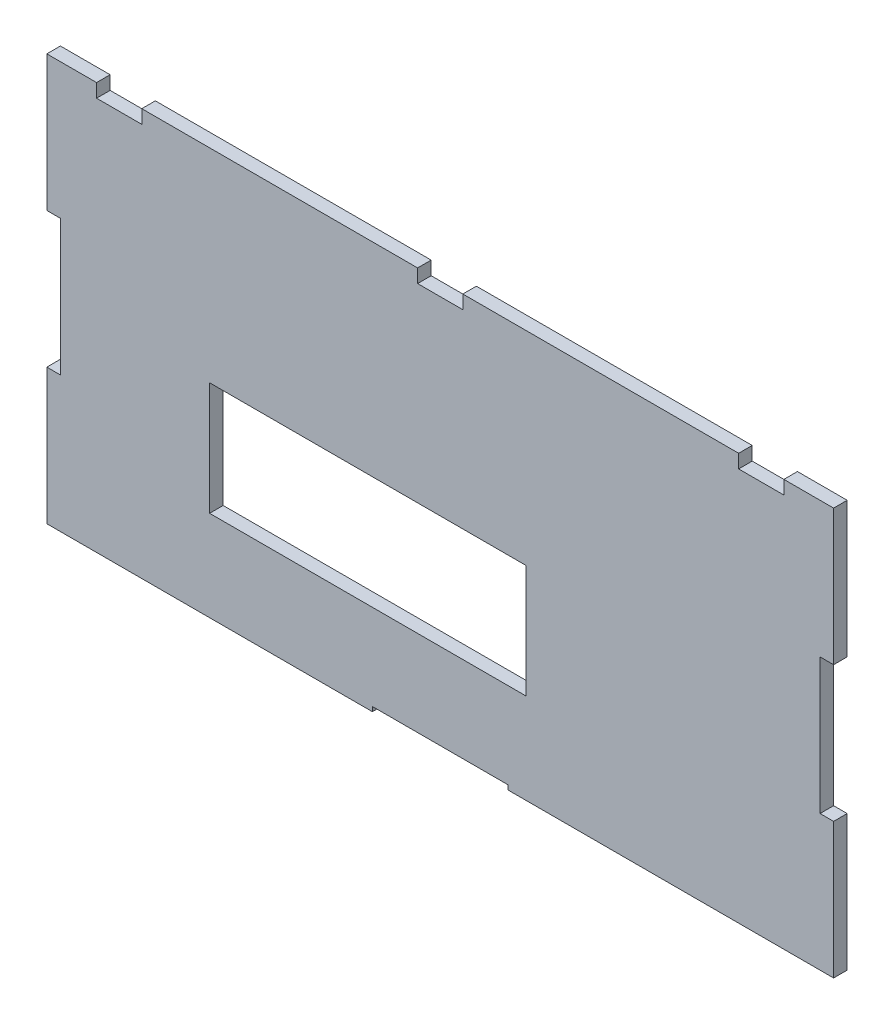
ISO-10303-21;
HEADER;
FILE_DESCRIPTION(('STEP AP214'),'2;1');
FILE_NAME('part.step','',(''),(''),'','','');
FILE_SCHEMA(('AUTOMOTIVE_DESIGN { 1 0 10303 214 1 1 1 1 }'));
ENDSEC;
DATA;
#1=APPLICATION_CONTEXT('core data for automotive mechanical design processes');
#2=APPLICATION_PROTOCOL_DEFINITION('international standard','automotive_design',2000,#1);
#3=PRODUCT_CONTEXT('',#1,'mechanical');
#4=PRODUCT('Part','Part','',(#3));
#5=PRODUCT_RELATED_PRODUCT_CATEGORY('part','',(#4));
#6=PRODUCT_DEFINITION_FORMATION('','',#4);
#7=PRODUCT_DEFINITION_CONTEXT('part definition',#1,'design');
#8=PRODUCT_DEFINITION('design','',#6,#7);
#9=PRODUCT_DEFINITION_SHAPE('','',#8);
#10=(LENGTH_UNIT() NAMED_UNIT(*) SI_UNIT(.MILLI.,.METRE.));
#11=(NAMED_UNIT(*) PLANE_ANGLE_UNIT() SI_UNIT($,.RADIAN.));
#12=(NAMED_UNIT(*) SI_UNIT($,.STERADIAN.) SOLID_ANGLE_UNIT());
#13=UNCERTAINTY_MEASURE_WITH_UNIT(LENGTH_MEASURE(1.E-05),#10,'distance_accuracy_value','');
#14=(GEOMETRIC_REPRESENTATION_CONTEXT(3) GLOBAL_UNCERTAINTY_ASSIGNED_CONTEXT((#13)) GLOBAL_UNIT_ASSIGNED_CONTEXT((#10,
#11,#12)) REPRESENTATION_CONTEXT('',''));
#15=CARTESIAN_POINT('',(0.,0.,0.));
#16=DIRECTION('',(0.,0.,1.));
#17=DIRECTION('',(1.,0.,0.));
#18=AXIS2_PLACEMENT_3D('',#15,#16,#17);
#19=CARTESIAN_POINT('',(0.,0.,3.));
#20=DIRECTION('',(0.,0.,1.));
#21=DIRECTION('',(1.,0.,0.));
#22=AXIS2_PLACEMENT_3D('',#19,#20,#21);
#23=PLANE('',#22);
#24=DIRECTION('',(1.,0.,0.));
#25=VECTOR('',#24,1.);
#26=CARTESIAN_POINT('',(180.402887007917,-58.0847241042454,3.));
#27=LINE('',#26,#25);
#28=CARTESIAN_POINT('',(180.402887007917,-58.0847241042454,3.));
#29=VERTEX_POINT('',#28);
#30=CARTESIAN_POINT('',(252.402887007917,-58.0847241042454,3.));
#31=VERTEX_POINT('',#30);
#32=EDGE_CURVE('E277',#29,#31,#27,.T.);
#33=ORIENTED_EDGE('',*,*,#32,.T.);
#34=DIRECTION('',(0.,1.,0.));
#35=VECTOR('',#34,1.);
#36=CARTESIAN_POINT('',(252.402887007917,-58.0847241042454,3.));
#37=LINE('',#36,#35);
#38=CARTESIAN_POINT('',(252.402887007917,-28.0847241042453,3.));
#39=VERTEX_POINT('',#38);
#40=EDGE_CURVE('E280',#31,#39,#37,.T.);
#41=ORIENTED_EDGE('',*,*,#40,.T.);
#42=DIRECTION('',(-1.,0.,0.));
#43=VECTOR('',#42,1.);
#44=CARTESIAN_POINT('',(252.402887007917,-28.0847241042453,3.));
#45=LINE('',#44,#43);
#46=CARTESIAN_POINT('',(249.402887007917,-28.0847241042452,3.));
#47=VERTEX_POINT('',#46);
#48=EDGE_CURVE('E283',#39,#47,#45,.T.);
#49=ORIENTED_EDGE('',*,*,#48,.T.);
#50=DIRECTION('',(0.,1.,0.));
#51=VECTOR('',#50,1.);
#52=CARTESIAN_POINT('',(249.402887007917,1.91527589575478,3.));
#53=LINE('',#52,#51);
#54=CARTESIAN_POINT('',(249.402887007917,1.91527589575478,3.));
#55=VERTEX_POINT('',#54);
#56=EDGE_CURVE('E285',#47,#55,#53,.T.);
#57=ORIENTED_EDGE('',*,*,#56,.T.);
#58=DIRECTION('',(1.,0.,0.));
#59=VECTOR('',#58,1.);
#60=CARTESIAN_POINT('',(249.402887007917,1.91527589575478,3.));
#61=LINE('',#60,#59);
#62=CARTESIAN_POINT('',(252.402887007917,1.91527589575481,3.));
#63=VERTEX_POINT('',#62);
#64=EDGE_CURVE('E287',#55,#63,#61,.T.);
#65=ORIENTED_EDGE('',*,*,#64,.T.);
#66=DIRECTION('',(0.,1.,0.));
#67=VECTOR('',#66,1.);
#68=CARTESIAN_POINT('',(252.402887007917,1.91527589575481,3.));
#69=LINE('',#68,#67);
#70=CARTESIAN_POINT('',(252.402887007917,31.9152758957548,3.));
#71=VERTEX_POINT('',#70);
#72=EDGE_CURVE('E289',#63,#71,#69,.T.);
#73=ORIENTED_EDGE('',*,*,#72,.T.);
#74=DIRECTION('',(-1.,0.,0.));
#75=VECTOR('',#74,1.);
#76=CARTESIAN_POINT('',(241.402887007917,31.9152758957548,3.));
#77=LINE('',#76,#75);
#78=CARTESIAN_POINT('',(241.402887007917,31.9152758957548,3.));
#79=VERTEX_POINT('',#78);
#80=EDGE_CURVE('E291',#71,#79,#77,.T.);
#81=ORIENTED_EDGE('',*,*,#80,.T.);
#82=DIRECTION('',(0.,-1.,0.));
#83=VECTOR('',#82,1.);
#84=CARTESIAN_POINT('',(241.402887007917,28.9152758957548,3.));
#85=LINE('',#84,#83);
#86=CARTESIAN_POINT('',(241.402887007917,28.9152758957548,3.));
#87=VERTEX_POINT('',#86);
#88=EDGE_CURVE('E293',#79,#87,#85,.T.);
#89=ORIENTED_EDGE('',*,*,#88,.T.);
#90=DIRECTION('',(-1.,0.,0.));
#91=VECTOR('',#90,1.);
#92=CARTESIAN_POINT('',(231.402887007916,28.9152758957548,3.));
#93=LINE('',#92,#91);
#94=CARTESIAN_POINT('',(231.402887007916,28.9152758957548,3.));
#95=VERTEX_POINT('',#94);
#96=EDGE_CURVE('E295',#87,#95,#93,.T.);
#97=ORIENTED_EDGE('',*,*,#96,.T.);
#98=DIRECTION('',(0.,1.,0.));
#99=VECTOR('',#98,1.);
#100=CARTESIAN_POINT('',(231.402887007916,31.9152758957548,3.));
#101=LINE('',#100,#99);
#102=CARTESIAN_POINT('',(231.402887007916,31.9152758957548,3.));
#103=VERTEX_POINT('',#102);
#104=EDGE_CURVE('E297',#95,#103,#101,.T.);
#105=ORIENTED_EDGE('',*,*,#104,.T.);
#106=DIRECTION('',(-1.,0.,0.));
#107=VECTOR('',#106,1.);
#108=CARTESIAN_POINT('',(170.402887007916,31.9152758957548,3.));
#109=LINE('',#108,#107);
#110=CARTESIAN_POINT('',(170.402887007916,31.9152758957548,3.));
#111=VERTEX_POINT('',#110);
#112=EDGE_CURVE('E299',#103,#111,#109,.T.);
#113=ORIENTED_EDGE('',*,*,#112,.T.);
#114=DIRECTION('',(0.,-1.,0.));
#115=VECTOR('',#114,1.);
#116=CARTESIAN_POINT('',(170.402887007916,28.9152758957548,3.));
#117=LINE('',#116,#115);
#118=CARTESIAN_POINT('',(170.402887007916,28.9152758957548,3.));
#119=VERTEX_POINT('',#118);
#120=EDGE_CURVE('E301',#111,#119,#117,.T.);
#121=ORIENTED_EDGE('',*,*,#120,.T.);
#122=DIRECTION('',(-1.,0.,0.));
#123=VECTOR('',#122,1.);
#124=CARTESIAN_POINT('',(160.402887007916,28.9152758957548,3.));
#125=LINE('',#124,#123);
#126=CARTESIAN_POINT('',(160.402887007916,28.9152758957548,3.));
#127=VERTEX_POINT('',#126);
#128=EDGE_CURVE('E303',#119,#127,#125,.T.);
#129=ORIENTED_EDGE('',*,*,#128,.T.);
#130=DIRECTION('',(0.,1.,0.));
#131=VECTOR('',#130,1.);
#132=CARTESIAN_POINT('',(160.402887007916,31.9152758957548,3.));
#133=LINE('',#132,#131);
#134=CARTESIAN_POINT('',(160.402887007916,31.9152758957548,3.));
#135=VERTEX_POINT('',#134);
#136=EDGE_CURVE('E305',#127,#135,#133,.T.);
#137=ORIENTED_EDGE('',*,*,#136,.T.);
#138=DIRECTION('',(-1.,0.,0.));
#139=VECTOR('',#138,1.);
#140=CARTESIAN_POINT('',(99.4028870079165,31.9152758957548,3.));
#141=LINE('',#140,#139);
#142=CARTESIAN_POINT('',(99.4028870079165,31.9152758957548,3.));
#143=VERTEX_POINT('',#142);
#144=EDGE_CURVE('E307',#135,#143,#141,.T.);
#145=ORIENTED_EDGE('',*,*,#144,.T.);
#146=DIRECTION('',(0.,-1.,0.));
#147=VECTOR('',#146,1.);
#148=CARTESIAN_POINT('',(99.4028870079165,28.9152758957548,3.));
#149=LINE('',#148,#147);
#150=CARTESIAN_POINT('',(99.4028870079165,28.9152758957548,3.));
#151=VERTEX_POINT('',#150);
#152=EDGE_CURVE('E309',#143,#151,#149,.T.);
#153=ORIENTED_EDGE('',*,*,#152,.T.);
#154=DIRECTION('',(-1.,0.,0.));
#155=VECTOR('',#154,1.);
#156=CARTESIAN_POINT('',(89.4028870079165,28.9152758957548,3.));
#157=LINE('',#156,#155);
#158=CARTESIAN_POINT('',(89.4028870079165,28.9152758957548,3.));
#159=VERTEX_POINT('',#158);
#160=EDGE_CURVE('E311',#151,#159,#157,.T.);
#161=ORIENTED_EDGE('',*,*,#160,.T.);
#162=DIRECTION('',(0.,1.,0.));
#163=VECTOR('',#162,1.);
#164=CARTESIAN_POINT('',(89.4028870079165,31.9152758957548,3.));
#165=LINE('',#164,#163);
#166=CARTESIAN_POINT('',(89.4028870079165,31.9152758957548,3.));
#167=VERTEX_POINT('',#166);
#168=EDGE_CURVE('E313',#159,#167,#165,.T.);
#169=ORIENTED_EDGE('',*,*,#168,.T.);
#170=DIRECTION('',(-1.,0.,0.));
#171=VECTOR('',#170,1.);
#172=CARTESIAN_POINT('',(78.4028870079165,31.9152758957548,3.));
#173=LINE('',#172,#171);
#174=CARTESIAN_POINT('',(78.4028870079165,31.9152758957548,3.));
#175=VERTEX_POINT('',#174);
#176=EDGE_CURVE('E315',#167,#175,#173,.T.);
#177=ORIENTED_EDGE('',*,*,#176,.T.);
#178=DIRECTION('',(0.,-1.,0.));
#179=VECTOR('',#178,1.);
#180=CARTESIAN_POINT('',(78.4028870079165,31.9152758957548,3.));
#181=LINE('',#180,#179);
#182=CARTESIAN_POINT('',(78.4028870079165,1.91527589575479,3.));
#183=VERTEX_POINT('',#182);
#184=EDGE_CURVE('E317',#175,#183,#181,.T.);
#185=ORIENTED_EDGE('',*,*,#184,.T.);
#186=DIRECTION('',(1.,0.,0.));
#187=VECTOR('',#186,1.);
#188=CARTESIAN_POINT('',(78.4028870079165,1.91527589575479,3.));
#189=LINE('',#188,#187);
#190=CARTESIAN_POINT('',(81.4028870079165,1.91527589575478,3.));
#191=VERTEX_POINT('',#190);
#192=EDGE_CURVE('E319',#183,#191,#189,.T.);
#193=ORIENTED_EDGE('',*,*,#192,.T.);
#194=DIRECTION('',(0.,-1.,0.));
#195=VECTOR('',#194,1.);
#196=CARTESIAN_POINT('',(81.4028870079165,1.91527589575478,3.));
#197=LINE('',#196,#195);
#198=CARTESIAN_POINT('',(81.4028870079165,-28.0847241042452,3.));
#199=VERTEX_POINT('',#198);
#200=EDGE_CURVE('E321',#191,#199,#197,.T.);
#201=ORIENTED_EDGE('',*,*,#200,.T.);
#202=DIRECTION('',(-1.,0.,0.));
#203=VECTOR('',#202,1.);
#204=CARTESIAN_POINT('',(81.4028870079165,-28.0847241042452,3.));
#205=LINE('',#204,#203);
#206=CARTESIAN_POINT('',(78.4028870079166,-28.0847241042453,3.));
#207=VERTEX_POINT('',#206);
#208=EDGE_CURVE('E323',#199,#207,#205,.T.);
#209=ORIENTED_EDGE('',*,*,#208,.T.);
#210=DIRECTION('',(0.,-1.,0.));
#211=VECTOR('',#210,1.);
#212=CARTESIAN_POINT('',(78.4028870079166,-28.0847241042453,3.));
#213=LINE('',#212,#211);
#214=CARTESIAN_POINT('',(78.4028870079165,-58.0847241042454,3.));
#215=VERTEX_POINT('',#214);
#216=EDGE_CURVE('E325',#207,#215,#213,.T.);
#217=ORIENTED_EDGE('',*,*,#216,.T.);
#218=DIRECTION('',(1.,0.,0.));
#219=VECTOR('',#218,1.);
#220=CARTESIAN_POINT('',(78.4028870079165,-58.0847241042454,3.));
#221=LINE('',#220,#219);
#222=CARTESIAN_POINT('',(150.402887007917,-58.0847241042454,3.));
#223=VERTEX_POINT('',#222);
#224=EDGE_CURVE('E327',#215,#223,#221,.T.);
#225=ORIENTED_EDGE('',*,*,#224,.T.);
#226=DIRECTION('',(0.,1.,0.));
#227=VECTOR('',#226,1.);
#228=CARTESIAN_POINT('',(150.402887007917,-57.0847241042454,3.));
#229=LINE('',#228,#227);
#230=CARTESIAN_POINT('',(150.402887007917,-57.0847241042454,3.));
#231=VERTEX_POINT('',#230);
#232=EDGE_CURVE('E329',#223,#231,#229,.T.);
#233=ORIENTED_EDGE('',*,*,#232,.T.);
#234=DIRECTION('',(1.,0.,0.));
#235=VECTOR('',#234,1.);
#236=CARTESIAN_POINT('',(180.402887007917,-57.0847241042454,3.));
#237=LINE('',#236,#235);
#238=CARTESIAN_POINT('',(180.402887007917,-57.0847241042454,3.));
#239=VERTEX_POINT('',#238);
#240=EDGE_CURVE('E331',#231,#239,#237,.T.);
#241=ORIENTED_EDGE('',*,*,#240,.T.);
#242=DIRECTION('',(0.,-1.,0.));
#243=VECTOR('',#242,1.);
#244=CARTESIAN_POINT('',(180.402887007917,-58.0847241042454,3.));
#245=LINE('',#244,#243);
#246=EDGE_CURVE('E333',#239,#29,#245,.T.);
#247=ORIENTED_EDGE('',*,*,#246,.T.);
#248=EDGE_LOOP('',(#33,#41,#49,#57,#65,#73,#81,#89,#97,#105,#113,#121,#129,#137,#145,#153,#161,
#169,#177,#185,#193,#201,#209,#217,#225,#233,#241,#247));
#249=FACE_BOUND('',#248,.T.);
#250=DIRECTION('',(-1.,0.,0.));
#251=VECTOR('',#250,1.);
#252=CARTESIAN_POINT('',(114.402887007917,-13.0847241042452,3.));
#253=LINE('',#252,#251);
#254=CARTESIAN_POINT('',(184.402887007917,-13.0847241042452,3.));
#255=VERTEX_POINT('',#254);
#256=CARTESIAN_POINT('',(114.402887007917,-13.0847241042452,3.));
#257=VERTEX_POINT('',#256);
#258=EDGE_CURVE('E249',#255,#257,#253,.T.);
#259=ORIENTED_EDGE('',*,*,#258,.F.);
#260=DIRECTION('',(0.,1.,0.));
#261=VECTOR('',#260,1.);
#262=CARTESIAN_POINT('',(184.402887007917,-13.0847241042452,3.));
#263=LINE('',#262,#261);
#264=CARTESIAN_POINT('',(184.402887007917,-38.0847241042452,3.));
#265=VERTEX_POINT('',#264);
#266=EDGE_CURVE('E241',#265,#255,#263,.T.);
#267=ORIENTED_EDGE('',*,*,#266,.F.);
#268=DIRECTION('',(1.,0.,0.));
#269=VECTOR('',#268,1.);
#270=CARTESIAN_POINT('',(184.402887007917,-38.0847241042452,3.));
#271=LINE('',#270,#269);
#272=CARTESIAN_POINT('',(114.402887007917,-38.0847241042452,3.));
#273=VERTEX_POINT('',#272);
#274=EDGE_CURVE('E263',#273,#265,#271,.T.);
#275=ORIENTED_EDGE('',*,*,#274,.F.);
#276=DIRECTION('',(0.,-1.,0.));
#277=VECTOR('',#276,1.);
#278=CARTESIAN_POINT('',(114.402887007917,-38.0847241042452,3.));
#279=LINE('',#278,#277);
#280=EDGE_CURVE('E261',#257,#273,#279,.T.);
#281=ORIENTED_EDGE('',*,*,#280,.F.);
#282=EDGE_LOOP('',(#259,#267,#275,#281));
#283=FACE_BOUND('',#282,.T.);
#284=ADVANCED_FACE('F32',(#249,#283),#23,.T.);
#285=CARTESIAN_POINT('',(0.,0.,0.));
#286=DIRECTION('',(0.,0.,1.));
#287=DIRECTION('',(1.,0.,0.));
#288=AXIS2_PLACEMENT_3D('',#285,#286,#287);
#289=PLANE('',#288);
#290=DIRECTION('',(1.,0.,0.));
#291=VECTOR('',#290,1.);
#292=CARTESIAN_POINT('',(180.402887007917,-58.0847241042454,0.));
#293=LINE('',#292,#291);
#294=CARTESIAN_POINT('',(180.402887007917,-58.0847241042454,0.));
#295=VERTEX_POINT('',#294);
#296=CARTESIAN_POINT('',(252.402887007917,-58.0847241042454,0.));
#297=VERTEX_POINT('',#296);
#298=EDGE_CURVE('E257',#295,#297,#293,.T.);
#299=ORIENTED_EDGE('',*,*,#298,.F.);
#300=DIRECTION('',(0.,-1.,0.));
#301=VECTOR('',#300,1.);
#302=CARTESIAN_POINT('',(180.402887007917,-58.0847241042454,0.));
#303=LINE('',#302,#301);
#304=CARTESIAN_POINT('',(180.402887007917,-57.0847241042454,0.));
#305=VERTEX_POINT('',#304);
#306=EDGE_CURVE('E281',#305,#295,#303,.T.);
#307=ORIENTED_EDGE('',*,*,#306,.F.);
#308=DIRECTION('',(1.,0.,0.));
#309=VECTOR('',#308,1.);
#310=CARTESIAN_POINT('',(180.402887007917,-57.0847241042454,0.));
#311=LINE('',#310,#309);
#312=CARTESIAN_POINT('',(150.402887007917,-57.0847241042454,0.));
#313=VERTEX_POINT('',#312);
#314=EDGE_CURVE('E388',#313,#305,#311,.T.);
#315=ORIENTED_EDGE('',*,*,#314,.F.);
#316=DIRECTION('',(0.,1.,0.));
#317=VECTOR('',#316,1.);
#318=CARTESIAN_POINT('',(150.402887007917,-57.0847241042454,0.));
#319=LINE('',#318,#317);
#320=CARTESIAN_POINT('',(150.402887007917,-58.0847241042454,0.));
#321=VERTEX_POINT('',#320);
#322=EDGE_CURVE('E386',#321,#313,#319,.T.);
#323=ORIENTED_EDGE('',*,*,#322,.F.);
#324=DIRECTION('',(1.,0.,0.));
#325=VECTOR('',#324,1.);
#326=CARTESIAN_POINT('',(78.4028870079165,-58.0847241042454,0.));
#327=LINE('',#326,#325);
#328=CARTESIAN_POINT('',(78.4028870079165,-58.0847241042454,0.));
#329=VERTEX_POINT('',#328);
#330=EDGE_CURVE('E384',#329,#321,#327,.T.);
#331=ORIENTED_EDGE('',*,*,#330,.F.);
#332=DIRECTION('',(0.,-1.,0.));
#333=VECTOR('',#332,1.);
#334=CARTESIAN_POINT('',(78.4028870079166,-28.0847241042453,0.));
#335=LINE('',#334,#333);
#336=CARTESIAN_POINT('',(78.4028870079166,-28.0847241042453,0.));
#337=VERTEX_POINT('',#336);
#338=EDGE_CURVE('E382',#337,#329,#335,.T.);
#339=ORIENTED_EDGE('',*,*,#338,.F.);
#340=DIRECTION('',(-1.,0.,0.));
#341=VECTOR('',#340,1.);
#342=CARTESIAN_POINT('',(81.4028870079165,-28.0847241042452,0.));
#343=LINE('',#342,#341);
#344=CARTESIAN_POINT('',(81.4028870079165,-28.0847241042452,0.));
#345=VERTEX_POINT('',#344);
#346=EDGE_CURVE('E380',#345,#337,#343,.T.);
#347=ORIENTED_EDGE('',*,*,#346,.F.);
#348=DIRECTION('',(0.,-1.,0.));
#349=VECTOR('',#348,1.);
#350=CARTESIAN_POINT('',(81.4028870079165,1.91527589575478,0.));
#351=LINE('',#350,#349);
#352=CARTESIAN_POINT('',(81.4028870079165,1.91527589575478,0.));
#353=VERTEX_POINT('',#352);
#354=EDGE_CURVE('E378',#353,#345,#351,.T.);
#355=ORIENTED_EDGE('',*,*,#354,.F.);
#356=DIRECTION('',(1.,0.,0.));
#357=VECTOR('',#356,1.);
#358=CARTESIAN_POINT('',(78.4028870079165,1.91527589575479,0.));
#359=LINE('',#358,#357);
#360=CARTESIAN_POINT('',(78.4028870079165,1.91527589575479,0.));
#361=VERTEX_POINT('',#360);
#362=EDGE_CURVE('E376',#361,#353,#359,.T.);
#363=ORIENTED_EDGE('',*,*,#362,.F.);
#364=DIRECTION('',(0.,-1.,0.));
#365=VECTOR('',#364,1.);
#366=CARTESIAN_POINT('',(78.4028870079165,31.9152758957548,0.));
#367=LINE('',#366,#365);
#368=CARTESIAN_POINT('',(78.4028870079165,31.9152758957548,0.));
#369=VERTEX_POINT('',#368);
#370=EDGE_CURVE('E374',#369,#361,#367,.T.);
#371=ORIENTED_EDGE('',*,*,#370,.F.);
#372=DIRECTION('',(-1.,0.,0.));
#373=VECTOR('',#372,1.);
#374=CARTESIAN_POINT('',(78.4028870079165,31.9152758957548,0.));
#375=LINE('',#374,#373);
#376=CARTESIAN_POINT('',(89.4028870079165,31.9152758957548,0.));
#377=VERTEX_POINT('',#376);
#378=EDGE_CURVE('E372',#377,#369,#375,.T.);
#379=ORIENTED_EDGE('',*,*,#378,.F.);
#380=DIRECTION('',(0.,1.,0.));
#381=VECTOR('',#380,1.);
#382=CARTESIAN_POINT('',(89.4028870079165,31.9152758957548,0.));
#383=LINE('',#382,#381);
#384=CARTESIAN_POINT('',(89.4028870079165,28.9152758957548,0.));
#385=VERTEX_POINT('',#384);
#386=EDGE_CURVE('E370',#385,#377,#383,.T.);
#387=ORIENTED_EDGE('',*,*,#386,.F.);
#388=DIRECTION('',(-1.,0.,0.));
#389=VECTOR('',#388,1.);
#390=CARTESIAN_POINT('',(89.4028870079165,28.9152758957548,0.));
#391=LINE('',#390,#389);
#392=CARTESIAN_POINT('',(99.4028870079165,28.9152758957548,0.));
#393=VERTEX_POINT('',#392);
#394=EDGE_CURVE('E368',#393,#385,#391,.T.);
#395=ORIENTED_EDGE('',*,*,#394,.F.);
#396=DIRECTION('',(0.,-1.,0.));
#397=VECTOR('',#396,1.);
#398=CARTESIAN_POINT('',(99.4028870079165,28.9152758957548,0.));
#399=LINE('',#398,#397);
#400=CARTESIAN_POINT('',(99.4028870079165,31.9152758957548,0.));
#401=VERTEX_POINT('',#400);
#402=EDGE_CURVE('E366',#401,#393,#399,.T.);
#403=ORIENTED_EDGE('',*,*,#402,.F.);
#404=DIRECTION('',(-1.,0.,0.));
#405=VECTOR('',#404,1.);
#406=CARTESIAN_POINT('',(99.4028870079165,31.9152758957548,0.));
#407=LINE('',#406,#405);
#408=CARTESIAN_POINT('',(160.402887007916,31.9152758957548,0.));
#409=VERTEX_POINT('',#408);
#410=EDGE_CURVE('E364',#409,#401,#407,.T.);
#411=ORIENTED_EDGE('',*,*,#410,.F.);
#412=DIRECTION('',(0.,1.,0.));
#413=VECTOR('',#412,1.);
#414=CARTESIAN_POINT('',(160.402887007916,31.9152758957548,0.));
#415=LINE('',#414,#413);
#416=CARTESIAN_POINT('',(160.402887007916,28.9152758957548,0.));
#417=VERTEX_POINT('',#416);
#418=EDGE_CURVE('E362',#417,#409,#415,.T.);
#419=ORIENTED_EDGE('',*,*,#418,.F.);
#420=DIRECTION('',(-1.,0.,0.));
#421=VECTOR('',#420,1.);
#422=CARTESIAN_POINT('',(160.402887007916,28.9152758957548,0.));
#423=LINE('',#422,#421);
#424=CARTESIAN_POINT('',(170.402887007916,28.9152758957548,0.));
#425=VERTEX_POINT('',#424);
#426=EDGE_CURVE('E360',#425,#417,#423,.T.);
#427=ORIENTED_EDGE('',*,*,#426,.F.);
#428=DIRECTION('',(0.,-1.,0.));
#429=VECTOR('',#428,1.);
#430=CARTESIAN_POINT('',(170.402887007916,28.9152758957548,0.));
#431=LINE('',#430,#429);
#432=CARTESIAN_POINT('',(170.402887007916,31.9152758957548,0.));
#433=VERTEX_POINT('',#432);
#434=EDGE_CURVE('E358',#433,#425,#431,.T.);
#435=ORIENTED_EDGE('',*,*,#434,.F.);
#436=DIRECTION('',(-1.,0.,0.));
#437=VECTOR('',#436,1.);
#438=CARTESIAN_POINT('',(170.402887007916,31.9152758957548,0.));
#439=LINE('',#438,#437);
#440=CARTESIAN_POINT('',(231.402887007916,31.9152758957548,0.));
#441=VERTEX_POINT('',#440);
#442=EDGE_CURVE('E356',#441,#433,#439,.T.);
#443=ORIENTED_EDGE('',*,*,#442,.F.);
#444=DIRECTION('',(0.,1.,0.));
#445=VECTOR('',#444,1.);
#446=CARTESIAN_POINT('',(231.402887007916,31.9152758957548,0.));
#447=LINE('',#446,#445);
#448=CARTESIAN_POINT('',(231.402887007916,28.9152758957548,0.));
#449=VERTEX_POINT('',#448);
#450=EDGE_CURVE('E354',#449,#441,#447,.T.);
#451=ORIENTED_EDGE('',*,*,#450,.F.);
#452=DIRECTION('',(-1.,0.,0.));
#453=VECTOR('',#452,1.);
#454=CARTESIAN_POINT('',(231.402887007916,28.9152758957548,0.));
#455=LINE('',#454,#453);
#456=CARTESIAN_POINT('',(241.402887007917,28.9152758957548,0.));
#457=VERTEX_POINT('',#456);
#458=EDGE_CURVE('E352',#457,#449,#455,.T.);
#459=ORIENTED_EDGE('',*,*,#458,.F.);
#460=DIRECTION('',(0.,-1.,0.));
#461=VECTOR('',#460,1.);
#462=CARTESIAN_POINT('',(241.402887007917,28.9152758957548,0.));
#463=LINE('',#462,#461);
#464=CARTESIAN_POINT('',(241.402887007917,31.9152758957548,0.));
#465=VERTEX_POINT('',#464);
#466=EDGE_CURVE('E350',#465,#457,#463,.T.);
#467=ORIENTED_EDGE('',*,*,#466,.F.);
#468=DIRECTION('',(-1.,0.,0.));
#469=VECTOR('',#468,1.);
#470=CARTESIAN_POINT('',(241.402887007917,31.9152758957548,0.));
#471=LINE('',#470,#469);
#472=CARTESIAN_POINT('',(252.402887007917,31.9152758957548,0.));
#473=VERTEX_POINT('',#472);
#474=EDGE_CURVE('E348',#473,#465,#471,.T.);
#475=ORIENTED_EDGE('',*,*,#474,.F.);
#476=DIRECTION('',(0.,1.,0.));
#477=VECTOR('',#476,1.);
#478=CARTESIAN_POINT('',(252.402887007917,1.91527589575481,0.));
#479=LINE('',#478,#477);
#480=CARTESIAN_POINT('',(252.402887007917,1.91527589575481,0.));
#481=VERTEX_POINT('',#480);
#482=EDGE_CURVE('E346',#481,#473,#479,.T.);
#483=ORIENTED_EDGE('',*,*,#482,.F.);
#484=DIRECTION('',(1.,0.,0.));
#485=VECTOR('',#484,1.);
#486=CARTESIAN_POINT('',(249.402887007917,1.91527589575478,0.));
#487=LINE('',#486,#485);
#488=CARTESIAN_POINT('',(249.402887007917,1.91527589575478,0.));
#489=VERTEX_POINT('',#488);
#490=EDGE_CURVE('E344',#489,#481,#487,.T.);
#491=ORIENTED_EDGE('',*,*,#490,.F.);
#492=DIRECTION('',(0.,1.,0.));
#493=VECTOR('',#492,1.);
#494=CARTESIAN_POINT('',(249.402887007917,1.91527589575478,0.));
#495=LINE('',#494,#493);
#496=CARTESIAN_POINT('',(249.402887007917,-28.0847241042452,0.));
#497=VERTEX_POINT('',#496);
#498=EDGE_CURVE('E342',#497,#489,#495,.T.);
#499=ORIENTED_EDGE('',*,*,#498,.F.);
#500=DIRECTION('',(-1.,0.,0.));
#501=VECTOR('',#500,1.);
#502=CARTESIAN_POINT('',(252.402887007917,-28.0847241042453,0.));
#503=LINE('',#502,#501);
#504=CARTESIAN_POINT('',(252.402887007917,-28.0847241042453,0.));
#505=VERTEX_POINT('',#504);
#506=EDGE_CURVE('E340',#505,#497,#503,.T.);
#507=ORIENTED_EDGE('',*,*,#506,.F.);
#508=DIRECTION('',(0.,1.,0.));
#509=VECTOR('',#508,1.);
#510=CARTESIAN_POINT('',(252.402887007917,-58.0847241042454,0.));
#511=LINE('',#510,#509);
#512=EDGE_CURVE('E338',#297,#505,#511,.T.);
#513=ORIENTED_EDGE('',*,*,#512,.F.);
#514=EDGE_LOOP('',(#299,#307,#315,#323,#331,#339,#347,#355,#363,#371,#379,#387,#395,#403,#411,
#419,#427,#435,#443,#451,#459,#467,#475,#483,#491,#499,#507,#513));
#515=FACE_BOUND('',#514,.T.);
#516=DIRECTION('',(0.,1.,0.));
#517=VECTOR('',#516,1.);
#518=CARTESIAN_POINT('',(184.402887007917,-13.0847241042452,0.));
#519=LINE('',#518,#517);
#520=CARTESIAN_POINT('',(184.402887007917,-38.0847241042452,0.));
#521=VERTEX_POINT('',#520);
#522=CARTESIAN_POINT('',(184.402887007917,-13.0847241042452,0.));
#523=VERTEX_POINT('',#522);
#524=EDGE_CURVE('E55',#521,#523,#519,.T.);
#525=ORIENTED_EDGE('',*,*,#524,.T.);
#526=DIRECTION('',(-1.,0.,0.));
#527=VECTOR('',#526,1.);
#528=CARTESIAN_POINT('',(114.402887007917,-13.0847241042452,0.));
#529=LINE('',#528,#527);
#530=CARTESIAN_POINT('',(114.402887007917,-13.0847241042452,0.));
#531=VERTEX_POINT('',#530);
#532=EDGE_CURVE('E256',#523,#531,#529,.T.);
#533=ORIENTED_EDGE('',*,*,#532,.T.);
#534=DIRECTION('',(0.,-1.,0.));
#535=VECTOR('',#534,1.);
#536=CARTESIAN_POINT('',(114.402887007917,-38.0847241042452,0.));
#537=LINE('',#536,#535);
#538=CARTESIAN_POINT('',(114.402887007917,-38.0847241042452,0.));
#539=VERTEX_POINT('',#538);
#540=EDGE_CURVE('E269',#531,#539,#537,.T.);
#541=ORIENTED_EDGE('',*,*,#540,.T.);
#542=DIRECTION('',(1.,0.,0.));
#543=VECTOR('',#542,1.);
#544=CARTESIAN_POINT('',(184.402887007917,-38.0847241042452,0.));
#545=LINE('',#544,#543);
#546=EDGE_CURVE('E250',#539,#521,#545,.T.);
#547=ORIENTED_EDGE('',*,*,#546,.T.);
#548=EDGE_LOOP('',(#525,#533,#541,#547));
#549=FACE_BOUND('',#548,.T.);
#550=ADVANCED_FACE('F478',(#515,#549),#289,.F.);
#551=CARTESIAN_POINT('',(180.402887007917,-58.0847241042454,3.));
#552=DIRECTION('',(0.,1.,0.));
#553=DIRECTION('',(0.,0.,1.));
#554=AXIS2_PLACEMENT_3D('',#551,#552,#553);
#555=PLANE('',#554);
#556=ORIENTED_EDGE('',*,*,#298,.T.);
#557=DIRECTION('',(0.,0.,-1.));
#558=VECTOR('',#557,1.);
#559=CARTESIAN_POINT('',(252.402887007917,-58.0847241042454,3.));
#560=LINE('',#559,#558);
#561=EDGE_CURVE('E11',#31,#297,#560,.T.);
#562=ORIENTED_EDGE('',*,*,#561,.F.);
#563=ORIENTED_EDGE('',*,*,#32,.F.);
#564=DIRECTION('',(0.,0.,-1.));
#565=VECTOR('',#564,1.);
#566=CARTESIAN_POINT('',(180.402887007917,-58.0847241042454,3.));
#567=LINE('',#566,#565);
#568=EDGE_CURVE('E335',#29,#295,#567,.T.);
#569=ORIENTED_EDGE('',*,*,#568,.T.);
#570=EDGE_LOOP('',(#556,#562,#563,#569));
#571=FACE_BOUND('',#570,.T.);
#572=ADVANCED_FACE('F34',(#571),#555,.F.);
#573=CARTESIAN_POINT('',(252.402887007917,-58.0847241042454,3.));
#574=DIRECTION('',(-1.,0.,0.));
#575=DIRECTION('',(0.,0.,1.));
#576=AXIS2_PLACEMENT_3D('',#573,#574,#575);
#577=PLANE('',#576);
#578=ORIENTED_EDGE('',*,*,#512,.T.);
#579=DIRECTION('',(0.,0.,-1.));
#580=VECTOR('',#579,1.);
#581=CARTESIAN_POINT('',(252.402887007917,-28.0847241042453,3.));
#582=LINE('',#581,#580);
#583=EDGE_CURVE('E40',#39,#505,#582,.T.);
#584=ORIENTED_EDGE('',*,*,#583,.F.);
#585=ORIENTED_EDGE('',*,*,#40,.F.);
#586=ORIENTED_EDGE('',*,*,#561,.T.);
#587=EDGE_LOOP('',(#578,#584,#585,#586));
#588=FACE_BOUND('',#587,.T.);
#589=ADVANCED_FACE('F495',(#588),#577,.F.);
#590=CARTESIAN_POINT('',(252.402887007917,-28.0847241042453,3.));
#591=DIRECTION('',(0.,-1.,0.));
#592=DIRECTION('',(1.,0.,0.));
#593=AXIS2_PLACEMENT_3D('',#590,#591,#592);
#594=PLANE('',#593);
#595=ORIENTED_EDGE('',*,*,#506,.T.);
#596=DIRECTION('',(0.,0.,-1.));
#597=VECTOR('',#596,1.);
#598=CARTESIAN_POINT('',(249.402887007917,-28.0847241042452,3.));
#599=LINE('',#598,#597);
#600=EDGE_CURVE('E465',#47,#497,#599,.T.);
#601=ORIENTED_EDGE('',*,*,#600,.F.);
#602=ORIENTED_EDGE('',*,*,#48,.F.);
#603=ORIENTED_EDGE('',*,*,#583,.T.);
#604=EDGE_LOOP('',(#595,#601,#602,#603));
#605=FACE_BOUND('',#604,.T.);
#606=ADVANCED_FACE('F472',(#605),#594,.F.);
#607=CARTESIAN_POINT('',(249.402887007917,1.91527589575478,3.));
#608=DIRECTION('',(-1.,0.,0.));
#609=DIRECTION('',(0.,0.,1.));
#610=AXIS2_PLACEMENT_3D('',#607,#608,#609);
#611=PLANE('',#610);
#612=ORIENTED_EDGE('',*,*,#498,.T.);
#613=DIRECTION('',(0.,0.,-1.));
#614=VECTOR('',#613,1.);
#615=CARTESIAN_POINT('',(249.402887007917,1.91527589575478,3.));
#616=LINE('',#615,#614);
#617=EDGE_CURVE('E462',#55,#489,#616,.T.);
#618=ORIENTED_EDGE('',*,*,#617,.F.);
#619=ORIENTED_EDGE('',*,*,#56,.F.);
#620=ORIENTED_EDGE('',*,*,#600,.T.);
#621=EDGE_LOOP('',(#612,#618,#619,#620));
#622=FACE_BOUND('',#621,.T.);
#623=ADVANCED_FACE('F484',(#622),#611,.F.);
#624=CARTESIAN_POINT('',(249.402887007917,1.91527589575478,3.));
#625=DIRECTION('',(0.,1.,0.));
#626=DIRECTION('',(-1.,0.,0.));
#627=AXIS2_PLACEMENT_3D('',#624,#625,#626);
#628=PLANE('',#627);
#629=ORIENTED_EDGE('',*,*,#490,.T.);
#630=DIRECTION('',(0.,0.,-1.));
#631=VECTOR('',#630,1.);
#632=CARTESIAN_POINT('',(252.402887007917,1.91527589575481,3.));
#633=LINE('',#632,#631);
#634=EDGE_CURVE('E459',#63,#481,#633,.T.);
#635=ORIENTED_EDGE('',*,*,#634,.F.);
#636=ORIENTED_EDGE('',*,*,#64,.F.);
#637=ORIENTED_EDGE('',*,*,#617,.T.);
#638=EDGE_LOOP('',(#629,#635,#636,#637));
#639=FACE_BOUND('',#638,.T.);
#640=ADVANCED_FACE('F488',(#639),#628,.F.);
#641=CARTESIAN_POINT('',(252.402887007917,1.91527589575481,3.));
#642=DIRECTION('',(-1.,0.,0.));
#643=DIRECTION('',(0.,0.,1.));
#644=AXIS2_PLACEMENT_3D('',#641,#642,#643);
#645=PLANE('',#644);
#646=ORIENTED_EDGE('',*,*,#482,.T.);
#647=DIRECTION('',(0.,0.,-1.));
#648=VECTOR('',#647,1.);
#649=CARTESIAN_POINT('',(252.402887007917,31.9152758957548,3.));
#650=LINE('',#649,#648);
#651=EDGE_CURVE('E456',#71,#473,#650,.T.);
#652=ORIENTED_EDGE('',*,*,#651,.F.);
#653=ORIENTED_EDGE('',*,*,#72,.F.);
#654=ORIENTED_EDGE('',*,*,#634,.T.);
#655=EDGE_LOOP('',(#646,#652,#653,#654));
#656=FACE_BOUND('',#655,.T.);
#657=ADVANCED_FACE('F608',(#656),#645,.F.);
#658=CARTESIAN_POINT('',(241.402887007917,31.9152758957548,3.));
#659=DIRECTION('',(0.,-1.,0.));
#660=DIRECTION('',(0.,0.,-1.));
#661=AXIS2_PLACEMENT_3D('',#658,#659,#660);
#662=PLANE('',#661);
#663=ORIENTED_EDGE('',*,*,#474,.T.);
#664=DIRECTION('',(0.,0.,-1.));
#665=VECTOR('',#664,1.);
#666=CARTESIAN_POINT('',(241.402887007917,31.9152758957548,3.));
#667=LINE('',#666,#665);
#668=EDGE_CURVE('E453',#79,#465,#667,.T.);
#669=ORIENTED_EDGE('',*,*,#668,.F.);
#670=ORIENTED_EDGE('',*,*,#80,.F.);
#671=ORIENTED_EDGE('',*,*,#651,.T.);
#672=EDGE_LOOP('',(#663,#669,#670,#671));
#673=FACE_BOUND('',#672,.T.);
#674=ADVANCED_FACE('F605',(#673),#662,.F.);
#675=CARTESIAN_POINT('',(241.402887007917,28.9152758957548,3.));
#676=DIRECTION('',(1.,0.,0.));
#677=DIRECTION('',(0.,0.,-1.));
#678=AXIS2_PLACEMENT_3D('',#675,#676,#677);
#679=PLANE('',#678);
#680=ORIENTED_EDGE('',*,*,#466,.T.);
#681=DIRECTION('',(0.,0.,-1.));
#682=VECTOR('',#681,1.);
#683=CARTESIAN_POINT('',(241.402887007917,28.9152758957548,3.));
#684=LINE('',#683,#682);
#685=EDGE_CURVE('E450',#87,#457,#684,.T.);
#686=ORIENTED_EDGE('',*,*,#685,.F.);
#687=ORIENTED_EDGE('',*,*,#88,.F.);
#688=ORIENTED_EDGE('',*,*,#668,.T.);
#689=EDGE_LOOP('',(#680,#686,#687,#688));
#690=FACE_BOUND('',#689,.T.);
#691=ADVANCED_FACE('F601',(#690),#679,.F.);
#692=CARTESIAN_POINT('',(231.402887007916,28.9152758957548,3.));
#693=DIRECTION('',(0.,-1.,0.));
#694=DIRECTION('',(0.,0.,-1.));
#695=AXIS2_PLACEMENT_3D('',#692,#693,#694);
#696=PLANE('',#695);
#697=ORIENTED_EDGE('',*,*,#458,.T.);
#698=DIRECTION('',(0.,0.,-1.));
#699=VECTOR('',#698,1.);
#700=CARTESIAN_POINT('',(231.402887007916,28.9152758957548,3.));
#701=LINE('',#700,#699);
#702=EDGE_CURVE('E447',#95,#449,#701,.T.);
#703=ORIENTED_EDGE('',*,*,#702,.F.);
#704=ORIENTED_EDGE('',*,*,#96,.F.);
#705=ORIENTED_EDGE('',*,*,#685,.T.);
#706=EDGE_LOOP('',(#697,#703,#704,#705));
#707=FACE_BOUND('',#706,.T.);
#708=ADVANCED_FACE('F597',(#707),#696,.F.);
#709=CARTESIAN_POINT('',(231.402887007916,31.9152758957548,3.));
#710=DIRECTION('',(-1.,0.,0.));
#711=DIRECTION('',(0.,0.,1.));
#712=AXIS2_PLACEMENT_3D('',#709,#710,#711);
#713=PLANE('',#712);
#714=ORIENTED_EDGE('',*,*,#450,.T.);
#715=DIRECTION('',(0.,0.,-1.));
#716=VECTOR('',#715,1.);
#717=CARTESIAN_POINT('',(231.402887007916,31.9152758957548,3.));
#718=LINE('',#717,#716);
#719=EDGE_CURVE('E444',#103,#441,#718,.T.);
#720=ORIENTED_EDGE('',*,*,#719,.F.);
#721=ORIENTED_EDGE('',*,*,#104,.F.);
#722=ORIENTED_EDGE('',*,*,#702,.T.);
#723=EDGE_LOOP('',(#714,#720,#721,#722));
#724=FACE_BOUND('',#723,.T.);
#725=ADVANCED_FACE('F592',(#724),#713,.F.);
#726=CARTESIAN_POINT('',(170.402887007916,31.9152758957548,3.));
#727=DIRECTION('',(0.,-1.,0.));
#728=DIRECTION('',(1.,0.,0.));
#729=AXIS2_PLACEMENT_3D('',#726,#727,#728);
#730=PLANE('',#729);
#731=ORIENTED_EDGE('',*,*,#442,.T.);
#732=DIRECTION('',(0.,0.,-1.));
#733=VECTOR('',#732,1.);
#734=CARTESIAN_POINT('',(170.402887007916,31.9152758957548,3.));
#735=LINE('',#734,#733);
#736=EDGE_CURVE('E441',#111,#433,#735,.T.);
#737=ORIENTED_EDGE('',*,*,#736,.F.);
#738=ORIENTED_EDGE('',*,*,#112,.F.);
#739=ORIENTED_EDGE('',*,*,#719,.T.);
#740=EDGE_LOOP('',(#731,#737,#738,#739));
#741=FACE_BOUND('',#740,.T.);
#742=ADVANCED_FACE('F586',(#741),#730,.F.);
#743=CARTESIAN_POINT('',(170.402887007916,28.9152758957548,3.));
#744=DIRECTION('',(1.,0.,0.));
#745=DIRECTION('',(0.,0.,-1.));
#746=AXIS2_PLACEMENT_3D('',#743,#744,#745);
#747=PLANE('',#746);
#748=ORIENTED_EDGE('',*,*,#434,.T.);
#749=DIRECTION('',(0.,0.,-1.));
#750=VECTOR('',#749,1.);
#751=CARTESIAN_POINT('',(170.402887007916,28.9152758957548,3.));
#752=LINE('',#751,#750);
#753=EDGE_CURVE('E438',#119,#425,#752,.T.);
#754=ORIENTED_EDGE('',*,*,#753,.F.);
#755=ORIENTED_EDGE('',*,*,#120,.F.);
#756=ORIENTED_EDGE('',*,*,#736,.T.);
#757=EDGE_LOOP('',(#748,#754,#755,#756));
#758=FACE_BOUND('',#757,.T.);
#759=ADVANCED_FACE('F582',(#758),#747,.F.);
#760=CARTESIAN_POINT('',(160.402887007916,28.9152758957548,3.));
#761=DIRECTION('',(0.,-1.,0.));
#762=DIRECTION('',(0.,0.,-1.));
#763=AXIS2_PLACEMENT_3D('',#760,#761,#762);
#764=PLANE('',#763);
#765=ORIENTED_EDGE('',*,*,#426,.T.);
#766=DIRECTION('',(0.,0.,-1.));
#767=VECTOR('',#766,1.);
#768=CARTESIAN_POINT('',(160.402887007916,28.9152758957548,3.));
#769=LINE('',#768,#767);
#770=EDGE_CURVE('E435',#127,#417,#769,.T.);
#771=ORIENTED_EDGE('',*,*,#770,.F.);
#772=ORIENTED_EDGE('',*,*,#128,.F.);
#773=ORIENTED_EDGE('',*,*,#753,.T.);
#774=EDGE_LOOP('',(#765,#771,#772,#773));
#775=FACE_BOUND('',#774,.T.);
#776=ADVANCED_FACE('F577',(#775),#764,.F.);
#777=CARTESIAN_POINT('',(160.402887007916,31.9152758957548,3.));
#778=DIRECTION('',(-1.,0.,0.));
#779=DIRECTION('',(0.,0.,1.));
#780=AXIS2_PLACEMENT_3D('',#777,#778,#779);
#781=PLANE('',#780);
#782=ORIENTED_EDGE('',*,*,#418,.T.);
#783=DIRECTION('',(0.,0.,-1.));
#784=VECTOR('',#783,1.);
#785=CARTESIAN_POINT('',(160.402887007916,31.9152758957548,3.));
#786=LINE('',#785,#784);
#787=EDGE_CURVE('E432',#135,#409,#786,.T.);
#788=ORIENTED_EDGE('',*,*,#787,.F.);
#789=ORIENTED_EDGE('',*,*,#136,.F.);
#790=ORIENTED_EDGE('',*,*,#770,.T.);
#791=EDGE_LOOP('',(#782,#788,#789,#790));
#792=FACE_BOUND('',#791,.T.);
#793=ADVANCED_FACE('F571',(#792),#781,.F.);
#794=CARTESIAN_POINT('',(99.4028870079165,31.9152758957548,3.));
#795=DIRECTION('',(0.,-1.,0.));
#796=DIRECTION('',(0.,0.,-1.));
#797=AXIS2_PLACEMENT_3D('',#794,#795,#796);
#798=PLANE('',#797);
#799=ORIENTED_EDGE('',*,*,#410,.T.);
#800=DIRECTION('',(0.,0.,-1.));
#801=VECTOR('',#800,1.);
#802=CARTESIAN_POINT('',(99.4028870079165,31.9152758957548,3.));
#803=LINE('',#802,#801);
#804=EDGE_CURVE('E429',#143,#401,#803,.T.);
#805=ORIENTED_EDGE('',*,*,#804,.F.);
#806=ORIENTED_EDGE('',*,*,#144,.F.);
#807=ORIENTED_EDGE('',*,*,#787,.T.);
#808=EDGE_LOOP('',(#799,#805,#806,#807));
#809=FACE_BOUND('',#808,.T.);
#810=ADVANCED_FACE('F567',(#809),#798,.F.);
#811=CARTESIAN_POINT('',(99.4028870079165,28.9152758957548,3.));
#812=DIRECTION('',(1.,0.,0.));
#813=DIRECTION('',(0.,0.,-1.));
#814=AXIS2_PLACEMENT_3D('',#811,#812,#813);
#815=PLANE('',#814);
#816=ORIENTED_EDGE('',*,*,#402,.T.);
#817=DIRECTION('',(0.,0.,-1.));
#818=VECTOR('',#817,1.);
#819=CARTESIAN_POINT('',(99.4028870079165,28.9152758957548,3.));
#820=LINE('',#819,#818);
#821=EDGE_CURVE('E426',#151,#393,#820,.T.);
#822=ORIENTED_EDGE('',*,*,#821,.F.);
#823=ORIENTED_EDGE('',*,*,#152,.F.);
#824=ORIENTED_EDGE('',*,*,#804,.T.);
#825=EDGE_LOOP('',(#816,#822,#823,#824));
#826=FACE_BOUND('',#825,.T.);
#827=ADVANCED_FACE('F562',(#826),#815,.F.);
#828=CARTESIAN_POINT('',(89.4028870079165,28.9152758957548,3.));
#829=DIRECTION('',(0.,-1.,0.));
#830=DIRECTION('',(1.,0.,0.));
#831=AXIS2_PLACEMENT_3D('',#828,#829,#830);
#832=PLANE('',#831);
#833=ORIENTED_EDGE('',*,*,#394,.T.);
#834=DIRECTION('',(0.,0.,-1.));
#835=VECTOR('',#834,1.);
#836=CARTESIAN_POINT('',(89.4028870079165,28.9152758957548,3.));
#837=LINE('',#836,#835);
#838=EDGE_CURVE('E423',#159,#385,#837,.T.);
#839=ORIENTED_EDGE('',*,*,#838,.F.);
#840=ORIENTED_EDGE('',*,*,#160,.F.);
#841=ORIENTED_EDGE('',*,*,#821,.T.);
#842=EDGE_LOOP('',(#833,#839,#840,#841));
#843=FACE_BOUND('',#842,.T.);
#844=ADVANCED_FACE('F556',(#843),#832,.F.);
#845=CARTESIAN_POINT('',(89.4028870079165,31.9152758957548,3.));
#846=DIRECTION('',(-1.,0.,0.));
#847=DIRECTION('',(0.,0.,1.));
#848=AXIS2_PLACEMENT_3D('',#845,#846,#847);
#849=PLANE('',#848);
#850=ORIENTED_EDGE('',*,*,#386,.T.);
#851=DIRECTION('',(0.,0.,-1.));
#852=VECTOR('',#851,1.);
#853=CARTESIAN_POINT('',(89.4028870079165,31.9152758957548,3.));
#854=LINE('',#853,#852);
#855=EDGE_CURVE('E420',#167,#377,#854,.T.);
#856=ORIENTED_EDGE('',*,*,#855,.F.);
#857=ORIENTED_EDGE('',*,*,#168,.F.);
#858=ORIENTED_EDGE('',*,*,#838,.T.);
#859=EDGE_LOOP('',(#850,#856,#857,#858));
#860=FACE_BOUND('',#859,.T.);
#861=ADVANCED_FACE('F552',(#860),#849,.F.);
#862=CARTESIAN_POINT('',(78.4028870079165,31.9152758957548,3.));
#863=DIRECTION('',(0.,-1.,0.));
#864=DIRECTION('',(1.,0.,0.));
#865=AXIS2_PLACEMENT_3D('',#862,#863,#864);
#866=PLANE('',#865);
#867=ORIENTED_EDGE('',*,*,#378,.T.);
#868=DIRECTION('',(0.,0.,-1.));
#869=VECTOR('',#868,1.);
#870=CARTESIAN_POINT('',(78.4028870079165,31.9152758957548,3.));
#871=LINE('',#870,#869);
#872=EDGE_CURVE('E417',#175,#369,#871,.T.);
#873=ORIENTED_EDGE('',*,*,#872,.F.);
#874=ORIENTED_EDGE('',*,*,#176,.F.);
#875=ORIENTED_EDGE('',*,*,#855,.T.);
#876=EDGE_LOOP('',(#867,#873,#874,#875));
#877=FACE_BOUND('',#876,.T.);
#878=ADVANCED_FACE('F547',(#877),#866,.F.);
#879=CARTESIAN_POINT('',(78.4028870079165,31.9152758957548,3.));
#880=DIRECTION('',(1.,0.,0.));
#881=DIRECTION('',(0.,0.,-1.));
#882=AXIS2_PLACEMENT_3D('',#879,#880,#881);
#883=PLANE('',#882);
#884=ORIENTED_EDGE('',*,*,#370,.T.);
#885=DIRECTION('',(0.,0.,-1.));
#886=VECTOR('',#885,1.);
#887=CARTESIAN_POINT('',(78.4028870079165,1.91527589575479,3.));
#888=LINE('',#887,#886);
#889=EDGE_CURVE('E414',#183,#361,#888,.T.);
#890=ORIENTED_EDGE('',*,*,#889,.F.);
#891=ORIENTED_EDGE('',*,*,#184,.F.);
#892=ORIENTED_EDGE('',*,*,#872,.T.);
#893=EDGE_LOOP('',(#884,#890,#891,#892));
#894=FACE_BOUND('',#893,.T.);
#895=ADVANCED_FACE('F541',(#894),#883,.F.);
#896=CARTESIAN_POINT('',(78.4028870079165,1.91527589575479,3.));
#897=DIRECTION('',(0.,1.,0.));
#898=DIRECTION('',(-1.,0.,0.));
#899=AXIS2_PLACEMENT_3D('',#896,#897,#898);
#900=PLANE('',#899);
#901=ORIENTED_EDGE('',*,*,#362,.T.);
#902=DIRECTION('',(0.,0.,-1.));
#903=VECTOR('',#902,1.);
#904=CARTESIAN_POINT('',(81.4028870079165,1.91527589575478,3.));
#905=LINE('',#904,#903);
#906=EDGE_CURVE('E411',#191,#353,#905,.T.);
#907=ORIENTED_EDGE('',*,*,#906,.F.);
#908=ORIENTED_EDGE('',*,*,#192,.F.);
#909=ORIENTED_EDGE('',*,*,#889,.T.);
#910=EDGE_LOOP('',(#901,#907,#908,#909));
#911=FACE_BOUND('',#910,.T.);
#912=ADVANCED_FACE('F537',(#911),#900,.F.);
#913=CARTESIAN_POINT('',(81.4028870079165,1.91527589575478,3.));
#914=DIRECTION('',(1.,0.,0.));
#915=DIRECTION('',(0.,0.,-1.));
#916=AXIS2_PLACEMENT_3D('',#913,#914,#915);
#917=PLANE('',#916);
#918=ORIENTED_EDGE('',*,*,#354,.T.);
#919=DIRECTION('',(0.,0.,-1.));
#920=VECTOR('',#919,1.);
#921=CARTESIAN_POINT('',(81.4028870079165,-28.0847241042452,3.));
#922=LINE('',#921,#920);
#923=EDGE_CURVE('E408',#199,#345,#922,.T.);
#924=ORIENTED_EDGE('',*,*,#923,.F.);
#925=ORIENTED_EDGE('',*,*,#200,.F.);
#926=ORIENTED_EDGE('',*,*,#906,.T.);
#927=EDGE_LOOP('',(#918,#924,#925,#926));
#928=FACE_BOUND('',#927,.T.);
#929=ADVANCED_FACE('F532',(#928),#917,.F.);
#930=CARTESIAN_POINT('',(81.4028870079165,-28.0847241042452,3.));
#931=DIRECTION('',(0.,-1.,0.));
#932=DIRECTION('',(1.,0.,0.));
#933=AXIS2_PLACEMENT_3D('',#930,#931,#932);
#934=PLANE('',#933);
#935=ORIENTED_EDGE('',*,*,#346,.T.);
#936=DIRECTION('',(0.,0.,-1.));
#937=VECTOR('',#936,1.);
#938=CARTESIAN_POINT('',(78.4028870079166,-28.0847241042453,3.));
#939=LINE('',#938,#937);
#940=EDGE_CURVE('E405',#207,#337,#939,.T.);
#941=ORIENTED_EDGE('',*,*,#940,.F.);
#942=ORIENTED_EDGE('',*,*,#208,.F.);
#943=ORIENTED_EDGE('',*,*,#923,.T.);
#944=EDGE_LOOP('',(#935,#941,#942,#943));
#945=FACE_BOUND('',#944,.T.);
#946=ADVANCED_FACE('F526',(#945),#934,.F.);
#947=CARTESIAN_POINT('',(78.4028870079166,-28.0847241042453,3.));
#948=DIRECTION('',(1.,0.,0.));
#949=DIRECTION('',(0.,1.,0.));
#950=AXIS2_PLACEMENT_3D('',#947,#948,#949);
#951=PLANE('',#950);
#952=ORIENTED_EDGE('',*,*,#338,.T.);
#953=DIRECTION('',(0.,0.,-1.));
#954=VECTOR('',#953,1.);
#955=CARTESIAN_POINT('',(78.4028870079165,-58.0847241042454,3.));
#956=LINE('',#955,#954);
#957=EDGE_CURVE('E402',#215,#329,#956,.T.);
#958=ORIENTED_EDGE('',*,*,#957,.F.);
#959=ORIENTED_EDGE('',*,*,#216,.F.);
#960=ORIENTED_EDGE('',*,*,#940,.T.);
#961=EDGE_LOOP('',(#952,#958,#959,#960));
#962=FACE_BOUND('',#961,.T.);
#963=ADVANCED_FACE('F522',(#962),#951,.F.);
#964=CARTESIAN_POINT('',(78.4028870079165,-58.0847241042454,3.));
#965=DIRECTION('',(0.,1.,0.));
#966=DIRECTION('',(0.,0.,1.));
#967=AXIS2_PLACEMENT_3D('',#964,#965,#966);
#968=PLANE('',#967);
#969=ORIENTED_EDGE('',*,*,#330,.T.);
#970=DIRECTION('',(0.,0.,-1.));
#971=VECTOR('',#970,1.);
#972=CARTESIAN_POINT('',(150.402887007917,-58.0847241042454,3.));
#973=LINE('',#972,#971);
#974=EDGE_CURVE('E399',#223,#321,#973,.T.);
#975=ORIENTED_EDGE('',*,*,#974,.F.);
#976=ORIENTED_EDGE('',*,*,#224,.F.);
#977=ORIENTED_EDGE('',*,*,#957,.T.);
#978=EDGE_LOOP('',(#969,#975,#976,#977));
#979=FACE_BOUND('',#978,.T.);
#980=ADVANCED_FACE('F517',(#979),#968,.F.);
#981=CARTESIAN_POINT('',(150.402887007917,-57.0847241042454,3.));
#982=DIRECTION('',(-1.,0.,0.));
#983=DIRECTION('',(0.,0.,1.));
#984=AXIS2_PLACEMENT_3D('',#981,#982,#983);
#985=PLANE('',#984);
#986=ORIENTED_EDGE('',*,*,#322,.T.);
#987=DIRECTION('',(0.,0.,-1.));
#988=VECTOR('',#987,1.);
#989=CARTESIAN_POINT('',(150.402887007917,-57.0847241042454,3.));
#990=LINE('',#989,#988);
#991=EDGE_CURVE('E396',#231,#313,#990,.T.);
#992=ORIENTED_EDGE('',*,*,#991,.F.);
#993=ORIENTED_EDGE('',*,*,#232,.F.);
#994=ORIENTED_EDGE('',*,*,#974,.T.);
#995=EDGE_LOOP('',(#986,#992,#993,#994));
#996=FACE_BOUND('',#995,.T.);
#997=ADVANCED_FACE('F511',(#996),#985,.F.);
#998=CARTESIAN_POINT('',(180.402887007917,-57.0847241042454,3.));
#999=DIRECTION('',(0.,1.,0.));
#1000=DIRECTION('',(-1.,0.,0.));
#1001=AXIS2_PLACEMENT_3D('',#998,#999,#1000);
#1002=PLANE('',#1001);
#1003=ORIENTED_EDGE('',*,*,#314,.T.);
#1004=DIRECTION('',(0.,0.,-1.));
#1005=VECTOR('',#1004,1.);
#1006=CARTESIAN_POINT('',(180.402887007917,-57.0847241042454,3.));
#1007=LINE('',#1006,#1005);
#1008=EDGE_CURVE('E393',#239,#305,#1007,.T.);
#1009=ORIENTED_EDGE('',*,*,#1008,.F.);
#1010=ORIENTED_EDGE('',*,*,#240,.F.);
#1011=ORIENTED_EDGE('',*,*,#991,.T.);
#1012=EDGE_LOOP('',(#1003,#1009,#1010,#1011));
#1013=FACE_BOUND('',#1012,.T.);
#1014=ADVANCED_FACE('F507',(#1013),#1002,.F.);
#1015=CARTESIAN_POINT('',(180.402887007917,-58.0847241042454,3.));
#1016=DIRECTION('',(1.,0.,0.));
#1017=DIRECTION('',(0.,0.,-1.));
#1018=AXIS2_PLACEMENT_3D('',#1015,#1016,#1017);
#1019=PLANE('',#1018);
#1020=ORIENTED_EDGE('',*,*,#306,.T.);
#1021=ORIENTED_EDGE('',*,*,#568,.F.);
#1022=ORIENTED_EDGE('',*,*,#246,.F.);
#1023=ORIENTED_EDGE('',*,*,#1008,.T.);
#1024=EDGE_LOOP('',(#1020,#1021,#1022,#1023));
#1025=FACE_BOUND('',#1024,.T.);
#1026=ADVANCED_FACE('F502',(#1025),#1019,.F.);
#1027=CARTESIAN_POINT('',(184.402887007917,-13.0847241042452,3.));
#1028=DIRECTION('',(-1.,0.,0.));
#1029=DIRECTION('',(0.,0.,1.));
#1030=AXIS2_PLACEMENT_3D('',#1027,#1028,#1029);
#1031=PLANE('',#1030);
#1032=ORIENTED_EDGE('',*,*,#524,.F.);
#1033=DIRECTION('',(0.,0.,-1.));
#1034=VECTOR('',#1033,1.);
#1035=CARTESIAN_POINT('',(184.402887007917,-38.0847241042452,3.));
#1036=LINE('',#1035,#1034);
#1037=EDGE_CURVE('E245',#265,#521,#1036,.T.);
#1038=ORIENTED_EDGE('',*,*,#1037,.F.);
#1039=ORIENTED_EDGE('',*,*,#266,.T.);
#1040=DIRECTION('',(0.,0.,-1.));
#1041=VECTOR('',#1040,1.);
#1042=CARTESIAN_POINT('',(184.402887007917,-13.0847241042452,3.));
#1043=LINE('',#1042,#1041);
#1044=EDGE_CURVE('E244',#255,#523,#1043,.T.);
#1045=ORIENTED_EDGE('',*,*,#1044,.T.);
#1046=EDGE_LOOP('',(#1032,#1038,#1039,#1045));
#1047=FACE_BOUND('',#1046,.T.);
#1048=ADVANCED_FACE('F243',(#1047),#1031,.T.);
#1049=CARTESIAN_POINT('',(114.402887007917,-13.0847241042452,3.));
#1050=DIRECTION('',(0.,-1.,0.));
#1051=DIRECTION('',(1.,0.,0.));
#1052=AXIS2_PLACEMENT_3D('',#1049,#1050,#1051);
#1053=PLANE('',#1052);
#1054=ORIENTED_EDGE('',*,*,#532,.F.);
#1055=ORIENTED_EDGE('',*,*,#1044,.F.);
#1056=ORIENTED_EDGE('',*,*,#258,.T.);
#1057=DIRECTION('',(0.,0.,-1.));
#1058=VECTOR('',#1057,1.);
#1059=CARTESIAN_POINT('',(114.402887007917,-13.0847241042452,3.));
#1060=LINE('',#1059,#1058);
#1061=EDGE_CURVE('E258',#257,#531,#1060,.T.);
#1062=ORIENTED_EDGE('',*,*,#1061,.T.);
#1063=EDGE_LOOP('',(#1054,#1055,#1056,#1062));
#1064=FACE_BOUND('',#1063,.T.);
#1065=ADVANCED_FACE('F253',(#1064),#1053,.T.);
#1066=CARTESIAN_POINT('',(114.402887007917,-38.0847241042452,3.));
#1067=DIRECTION('',(1.,0.,0.));
#1068=DIRECTION('',(0.,0.,-1.));
#1069=AXIS2_PLACEMENT_3D('',#1066,#1067,#1068);
#1070=PLANE('',#1069);
#1071=ORIENTED_EDGE('',*,*,#540,.F.);
#1072=ORIENTED_EDGE('',*,*,#1061,.F.);
#1073=ORIENTED_EDGE('',*,*,#280,.T.);
#1074=DIRECTION('',(0.,0.,-1.));
#1075=VECTOR('',#1074,1.);
#1076=CARTESIAN_POINT('',(114.402887007917,-38.0847241042452,3.));
#1077=LINE('',#1076,#1075);
#1078=EDGE_CURVE('E47',#273,#539,#1077,.T.);
#1079=ORIENTED_EDGE('',*,*,#1078,.T.);
#1080=EDGE_LOOP('',(#1071,#1072,#1073,#1079));
#1081=FACE_BOUND('',#1080,.T.);
#1082=ADVANCED_FACE('F762',(#1081),#1070,.T.);
#1083=CARTESIAN_POINT('',(184.402887007917,-38.0847241042452,3.));
#1084=DIRECTION('',(0.,1.,0.));
#1085=DIRECTION('',(-1.,0.,0.));
#1086=AXIS2_PLACEMENT_3D('',#1083,#1084,#1085);
#1087=PLANE('',#1086);
#1088=ORIENTED_EDGE('',*,*,#546,.F.);
#1089=ORIENTED_EDGE('',*,*,#1078,.F.);
#1090=ORIENTED_EDGE('',*,*,#274,.T.);
#1091=ORIENTED_EDGE('',*,*,#1037,.T.);
#1092=EDGE_LOOP('',(#1088,#1089,#1090,#1091));
#1093=FACE_BOUND('',#1092,.T.);
#1094=ADVANCED_FACE('F768',(#1093),#1087,.T.);
#1095=CLOSED_SHELL('',(#284,#550,#572,#589,#606,#623,#640,#657,#674,#691,#708,#725,#742,#759,
#776,#793,#810,#827,#844,#861,#878,#895,#912,#929,#946,#963,#980,#997,#1014,#1026,#1048,#1065,
#1082,#1094));
#1096=MANIFOLD_SOLID_BREP('B2',#1095);
#1097=ADVANCED_BREP_SHAPE_REPRESENTATION('',(#18,#1096),#14);
#1098=SHAPE_DEFINITION_REPRESENTATION(#9,#1097);
ENDSEC;
END-ISO-10303-21;
